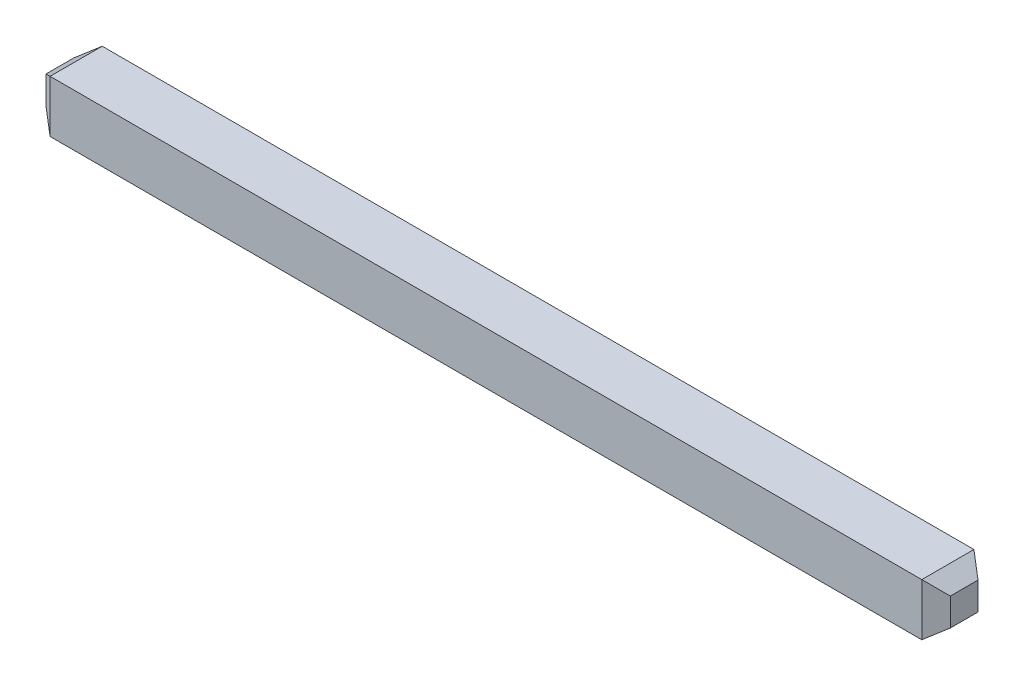
ISO-10303-21;
HEADER;
FILE_DESCRIPTION(('STEP AP214'),'2;1');
FILE_NAME('part.step','',(''),(''),'','','');
FILE_SCHEMA(('AUTOMOTIVE_DESIGN { 1 0 10303 214 1 1 1 1 }'));
ENDSEC;
DATA;
#1=APPLICATION_CONTEXT('core data for automotive mechanical design processes');
#2=APPLICATION_PROTOCOL_DEFINITION('international standard','automotive_design',2000,#1);
#3=PRODUCT_CONTEXT('',#1,'mechanical');
#4=PRODUCT('Part','Part','',(#3));
#5=PRODUCT_RELATED_PRODUCT_CATEGORY('part','',(#4));
#6=PRODUCT_DEFINITION_FORMATION('','',#4);
#7=PRODUCT_DEFINITION_CONTEXT('part definition',#1,'design');
#8=PRODUCT_DEFINITION('design','',#6,#7);
#9=PRODUCT_DEFINITION_SHAPE('','',#8);
#10=(LENGTH_UNIT() NAMED_UNIT(*) SI_UNIT(.MILLI.,.METRE.));
#11=(NAMED_UNIT(*) PLANE_ANGLE_UNIT() SI_UNIT($,.RADIAN.));
#12=(NAMED_UNIT(*) SI_UNIT($,.STERADIAN.) SOLID_ANGLE_UNIT());
#13=UNCERTAINTY_MEASURE_WITH_UNIT(LENGTH_MEASURE(1.E-05),#10,'distance_accuracy_value','');
#14=(GEOMETRIC_REPRESENTATION_CONTEXT(3) GLOBAL_UNCERTAINTY_ASSIGNED_CONTEXT((#13)) GLOBAL_UNIT_ASSIGNED_CONTEXT((#10,
#11,#12)) REPRESENTATION_CONTEXT('',''));
#15=CARTESIAN_POINT('',(0.,0.,0.));
#16=DIRECTION('',(0.,0.,1.));
#17=DIRECTION('',(1.,0.,0.));
#18=AXIS2_PLACEMENT_3D('',#15,#16,#17);
#19=CARTESIAN_POINT('',(-2.4,3.525,-11.43));
#20=DIRECTION('',(0.6,0.8,0.));
#21=DIRECTION('',(-0.8,0.6,0.));
#22=AXIS2_PLACEMENT_3D('',#19,#20,#21);
#23=PLANE('',#22);
#24=DIRECTION('',(0.,0.,1.));
#25=VECTOR('',#24,1.);
#26=CARTESIAN_POINT('',(-2.3,3.45,-11.43));
#27=LINE('',#26,#25);
#28=CARTESIAN_POINT('',(-2.29999999999978,3.45,-11.7499999999997));
#29=VERTEX_POINT('',#28);
#30=CARTESIAN_POINT('',(-2.29999999999978,3.45,-11.1100000000003));
#31=VERTEX_POINT('',#30);
#32=EDGE_CURVE('E105',#29,#31,#27,.T.);
#33=ORIENTED_EDGE('',*,*,#32,.T.);
#34=DIRECTION('',(0.685994340575993,-0.514495755427528,0.514495755419581));
#35=VECTOR('',#34,1.);
#36=CARTESIAN_POINT('',(-2.50000000000087,3.6,-11.2599999999988));
#37=LINE('',#36,#35);
#38=CARTESIAN_POINT('',(-2.50000000000022,3.6,-11.2599999999997));
#39=VERTEX_POINT('',#38);
#40=EDGE_CURVE('E92',#39,#31,#37,.T.);
#41=ORIENTED_EDGE('',*,*,#40,.F.);
#42=DIRECTION('',(0.,0.,-1.));
#43=VECTOR('',#42,1.);
#44=CARTESIAN_POINT('',(-2.5,3.6,-11.43));
#45=LINE('',#44,#43);
#46=CARTESIAN_POINT('',(-2.50000000000044,3.6,-11.6000000000006));
#47=VERTEX_POINT('',#46);
#48=EDGE_CURVE('E79',#39,#47,#45,.T.);
#49=ORIENTED_EDGE('',*,*,#48,.T.);
#50=DIRECTION('',(0.685994340575993,-0.514495755427525,-0.514495755419585));
#51=VECTOR('',#50,1.);
#52=CARTESIAN_POINT('',(-2.50000000000087,3.6,-11.6000000000012));
#53=LINE('',#52,#51);
#54=EDGE_CURVE('E20',#47,#29,#53,.T.);
#55=ORIENTED_EDGE('',*,*,#54,.T.);
#56=EDGE_LOOP('',(#33,#41,#49,#55));
#57=FACE_BOUND('',#56,.T.);
#58=ADVANCED_FACE('F17',(#57),#23,.F.);
#59=CARTESIAN_POINT('',(8.5,3.525,-11.43));
#60=DIRECTION('',(-0.6,0.8,0.));
#61=DIRECTION('',(-0.8,-0.6,0.));
#62=AXIS2_PLACEMENT_3D('',#59,#60,#61);
#63=PLANE('',#62);
#64=DIRECTION('',(0.,0.,-1.));
#65=VECTOR('',#64,1.);
#66=CARTESIAN_POINT('',(8.6,3.6,-11.43));
#67=LINE('',#66,#65);
#68=CARTESIAN_POINT('',(8.60000000000043,3.6,-11.2599999999994));
#69=VERTEX_POINT('',#68);
#70=CARTESIAN_POINT('',(8.60000000000022,3.6,-11.6000000000003));
#71=VERTEX_POINT('',#70);
#72=EDGE_CURVE('E114',#69,#71,#67,.T.);
#73=ORIENTED_EDGE('',*,*,#72,.F.);
#74=DIRECTION('',(0.685994340575991,0.514495755427529,-0.514495755419583));
#75=VECTOR('',#74,1.);
#76=CARTESIAN_POINT('',(8.39999999999913,3.45,-11.1100000000012));
#77=LINE('',#76,#75);
#78=CARTESIAN_POINT('',(8.39999999999989,3.45,-11.1100000000001));
#79=VERTEX_POINT('',#78);
#80=EDGE_CURVE('E109',#79,#69,#77,.T.);
#81=ORIENTED_EDGE('',*,*,#80,.F.);
#82=DIRECTION('',(0.,0.,1.));
#83=VECTOR('',#82,1.);
#84=CARTESIAN_POINT('',(8.4,3.45,-11.43));
#85=LINE('',#84,#83);
#86=CARTESIAN_POINT('',(8.39999999999978,3.45,-11.7499999999997));
#87=VERTEX_POINT('',#86);
#88=EDGE_CURVE('E103',#79,#87,#85,.F.);
#89=ORIENTED_EDGE('',*,*,#88,.T.);
#90=DIRECTION('',(0.685994340575991,0.514495755427529,0.514495755419583));
#91=VECTOR('',#90,1.);
#92=CARTESIAN_POINT('',(8.39999999999913,3.45,-11.7499999999988));
#93=LINE('',#92,#91);
#94=EDGE_CURVE('E107',#87,#71,#93,.T.);
#95=ORIENTED_EDGE('',*,*,#94,.T.);
#96=EDGE_LOOP('',(#73,#81,#89,#95));
#97=FACE_BOUND('',#96,.T.);
#98=ADVANCED_FACE('F175',(#97),#63,.F.);
#99=CARTESIAN_POINT('',(-2.4,3.77,-11.675));
#100=DIRECTION('',(0.599999999990736,0.,0.800000000006948));
#101=DIRECTION('',(0.800000000006948,0.,-0.599999999990736));
#102=AXIS2_PLACEMENT_3D('',#99,#100,#101);
#103=PLANE('',#102);
#104=DIRECTION('',(0.,1.,0.));
#105=VECTOR('',#104,1.);
#106=CARTESIAN_POINT('',(-2.3,3.77,-11.75));
#107=LINE('',#106,#105);
#108=CARTESIAN_POINT('',(-2.29999999999957,4.09,-11.7499999999994));
#109=VERTEX_POINT('',#108);
#110=EDGE_CURVE('E88',#109,#29,#107,.F.);
#111=ORIENTED_EDGE('',*,*,#110,.T.);
#112=ORIENTED_EDGE('',*,*,#54,.F.);
#113=DIRECTION('',(0.,1.,0.));
#114=VECTOR('',#113,1.);
#115=CARTESIAN_POINT('',(-2.5,3.77,-11.6));
#116=LINE('',#115,#114);
#117=CARTESIAN_POINT('',(-2.50000000000043,3.94,-11.6000000000006));
#118=VERTEX_POINT('',#117);
#119=EDGE_CURVE('E85',#47,#118,#116,.T.);
#120=ORIENTED_EDGE('',*,*,#119,.T.);
#121=DIRECTION('',(-0.685994340570035,-0.514495755427526,0.514495755427529));
#122=VECTOR('',#121,1.);
#123=CARTESIAN_POINT('',(-2.3,4.09,-11.75));
#124=LINE('',#123,#122);
#125=EDGE_CURVE('E126',#109,#118,#124,.T.);
#126=ORIENTED_EDGE('',*,*,#125,.F.);
#127=EDGE_LOOP('',(#111,#112,#120,#126));
#128=FACE_BOUND('',#127,.T.);
#129=ADVANCED_FACE('F84',(#128),#103,.F.);
#130=CARTESIAN_POINT('',(-2.5,3.77,-11.43));
#131=DIRECTION('',(1.,0.,0.));
#132=DIRECTION('',(0.,0.,-1.));
#133=AXIS2_PLACEMENT_3D('',#130,#131,#132);
#134=PLANE('',#133);
#135=DIRECTION('',(0.,1.,0.));
#136=VECTOR('',#135,1.);
#137=CARTESIAN_POINT('',(-2.50000000000087,3.77,-11.2599999999988));
#138=LINE('',#137,#136);
#139=CARTESIAN_POINT('',(-2.50000000000022,3.94,-11.2599999999997));
#140=VERTEX_POINT('',#139);
#141=EDGE_CURVE('E94',#140,#39,#138,.F.);
#142=ORIENTED_EDGE('',*,*,#141,.F.);
#143=DIRECTION('',(0.,0.,1.));
#144=VECTOR('',#143,1.);
#145=CARTESIAN_POINT('',(-2.5,3.94,-11.43));
#146=LINE('',#145,#144);
#147=EDGE_CURVE('E98',#118,#140,#146,.T.);
#148=ORIENTED_EDGE('',*,*,#147,.F.);
#149=ORIENTED_EDGE('',*,*,#119,.F.);
#150=ORIENTED_EDGE('',*,*,#48,.F.);
#151=EDGE_LOOP('',(#142,#148,#149,#150));
#152=FACE_BOUND('',#151,.T.);
#153=ADVANCED_FACE('F96',(#152),#134,.F.);
#154=CARTESIAN_POINT('',(-2.4,3.77,-11.185));
#155=DIRECTION('',(-0.599999999990736,0.,0.800000000006948));
#156=DIRECTION('',(0.800000000006948,0.,0.599999999990736));
#157=AXIS2_PLACEMENT_3D('',#154,#155,#156);
#158=PLANE('',#157);
#159=ORIENTED_EDGE('',*,*,#40,.T.);
#160=DIRECTION('',(0.,1.,0.));
#161=VECTOR('',#160,1.);
#162=CARTESIAN_POINT('',(-2.3,3.77,-11.11));
#163=LINE('',#162,#161);
#164=CARTESIAN_POINT('',(-2.29999999999957,4.09,-11.1100000000006));
#165=VERTEX_POINT('',#164);
#166=EDGE_CURVE('E132',#165,#31,#163,.F.);
#167=ORIENTED_EDGE('',*,*,#166,.F.);
#168=DIRECTION('',(0.685994340570037,0.514495755427527,0.514495755427524));
#169=VECTOR('',#168,1.);
#170=CARTESIAN_POINT('',(-2.5,3.94,-11.26));
#171=LINE('',#170,#169);
#172=EDGE_CURVE('E129',#140,#165,#171,.T.);
#173=ORIENTED_EDGE('',*,*,#172,.F.);
#174=ORIENTED_EDGE('',*,*,#141,.T.);
#175=EDGE_LOOP('',(#159,#167,#173,#174));
#176=FACE_BOUND('',#175,.T.);
#177=ADVANCED_FACE('F186',(#176),#158,.T.);
#178=CARTESIAN_POINT('',(3.05,3.45,-11.43));
#179=DIRECTION('',(0.,1.,0.));
#180=DIRECTION('',(0.,0.,1.));
#181=AXIS2_PLACEMENT_3D('',#178,#179,#180);
#182=PLANE('',#181);
#183=ORIENTED_EDGE('',*,*,#32,.F.);
#184=DIRECTION('',(1.,0.,0.));
#185=VECTOR('',#184,1.);
#186=CARTESIAN_POINT('',(3.05,3.45,-11.75));
#187=LINE('',#186,#185);
#188=EDGE_CURVE('E123',#29,#87,#187,.T.);
#189=ORIENTED_EDGE('',*,*,#188,.T.);
#190=ORIENTED_EDGE('',*,*,#88,.F.);
#191=DIRECTION('',(1.,0.,0.));
#192=VECTOR('',#191,1.);
#193=CARTESIAN_POINT('',(3.05,3.45,-11.11));
#194=LINE('',#193,#192);
#195=EDGE_CURVE('E135',#31,#79,#194,.T.);
#196=ORIENTED_EDGE('',*,*,#195,.F.);
#197=EDGE_LOOP('',(#183,#189,#190,#196));
#198=FACE_BOUND('',#197,.T.);
#199=ADVANCED_FACE('F179',(#198),#182,.F.);
#200=CARTESIAN_POINT('',(8.5,3.77,-11.675));
#201=DIRECTION('',(-0.599999999990736,0.,0.800000000006948));
#202=DIRECTION('',(0.800000000006948,0.,0.599999999990736));
#203=AXIS2_PLACEMENT_3D('',#200,#201,#202);
#204=PLANE('',#203);
#205=DIRECTION('',(0.,1.,0.));
#206=VECTOR('',#205,1.);
#207=CARTESIAN_POINT('',(8.6,3.77,-11.6));
#208=LINE('',#207,#206);
#209=CARTESIAN_POINT('',(8.60000000000043,3.94,-11.6000000000006));
#210=VERTEX_POINT('',#209);
#211=EDGE_CURVE('E117',#71,#210,#208,.T.);
#212=ORIENTED_EDGE('',*,*,#211,.F.);
#213=ORIENTED_EDGE('',*,*,#94,.F.);
#214=DIRECTION('',(0.,1.,0.));
#215=VECTOR('',#214,1.);
#216=CARTESIAN_POINT('',(8.4,3.77,-11.75));
#217=LINE('',#216,#215);
#218=CARTESIAN_POINT('',(8.39999999999957,4.09,-11.7499999999994));
#219=VERTEX_POINT('',#218);
#220=EDGE_CURVE('E120',#87,#219,#217,.T.);
#221=ORIENTED_EDGE('',*,*,#220,.T.);
#222=DIRECTION('',(-0.685994340570033,0.514495755427525,-0.514495755427531));
#223=VECTOR('',#222,1.);
#224=CARTESIAN_POINT('',(8.6,3.94,-11.6));
#225=LINE('',#224,#223);
#226=EDGE_CURVE('E140',#210,#219,#225,.T.);
#227=ORIENTED_EDGE('',*,*,#226,.F.);
#228=EDGE_LOOP('',(#212,#213,#221,#227));
#229=FACE_BOUND('',#228,.T.);
#230=ADVANCED_FACE('F167',(#229),#204,.F.);
#231=CARTESIAN_POINT('',(8.5,3.77,-11.185));
#232=DIRECTION('',(0.599999999990736,0.,0.800000000006948));
#233=DIRECTION('',(0.800000000006948,0.,-0.599999999990736));
#234=AXIS2_PLACEMENT_3D('',#231,#232,#233);
#235=PLANE('',#234);
#236=DIRECTION('',(0.685994340570035,-0.514495755427526,-0.514495755427526));
#237=VECTOR('',#236,1.);
#238=CARTESIAN_POINT('',(8.4,4.09,-11.11));
#239=LINE('',#238,#237);
#240=CARTESIAN_POINT('',(8.39999999999957,4.09,-11.1100000000006));
#241=VERTEX_POINT('',#240);
#242=CARTESIAN_POINT('',(8.60000000000043,3.94,-11.2599999999994));
#243=VERTEX_POINT('',#242);
#244=EDGE_CURVE('E35',#241,#243,#239,.T.);
#245=ORIENTED_EDGE('',*,*,#244,.F.);
#246=DIRECTION('',(0.,1.,0.));
#247=VECTOR('',#246,1.);
#248=CARTESIAN_POINT('',(8.4,3.77,-11.11));
#249=LINE('',#248,#247);
#250=EDGE_CURVE('E138',#79,#241,#249,.T.);
#251=ORIENTED_EDGE('',*,*,#250,.F.);
#252=ORIENTED_EDGE('',*,*,#80,.T.);
#253=DIRECTION('',(0.,1.,0.));
#254=VECTOR('',#253,1.);
#255=CARTESIAN_POINT('',(8.6,3.77,-11.26));
#256=LINE('',#255,#254);
#257=EDGE_CURVE('E111',#243,#69,#256,.F.);
#258=ORIENTED_EDGE('',*,*,#257,.F.);
#259=EDGE_LOOP('',(#245,#251,#252,#258));
#260=FACE_BOUND('',#259,.T.);
#261=ADVANCED_FACE('F211',(#260),#235,.T.);
#262=CARTESIAN_POINT('',(8.6,3.77,-11.43));
#263=DIRECTION('',(1.,0.,0.));
#264=DIRECTION('',(0.,0.,-1.));
#265=AXIS2_PLACEMENT_3D('',#262,#263,#264);
#266=PLANE('',#265);
#267=ORIENTED_EDGE('',*,*,#211,.T.);
#268=DIRECTION('',(0.,0.,1.));
#269=VECTOR('',#268,1.);
#270=CARTESIAN_POINT('',(8.6,3.94,-11.43));
#271=LINE('',#270,#269);
#272=EDGE_CURVE('E144',#243,#210,#271,.F.);
#273=ORIENTED_EDGE('',*,*,#272,.F.);
#274=ORIENTED_EDGE('',*,*,#257,.T.);
#275=ORIENTED_EDGE('',*,*,#72,.T.);
#276=EDGE_LOOP('',(#267,#273,#274,#275));
#277=FACE_BOUND('',#276,.T.);
#278=ADVANCED_FACE('F172',(#277),#266,.T.);
#279=CARTESIAN_POINT('',(3.05,3.77,-11.75));
#280=DIRECTION('',(0.,0.,1.));
#281=DIRECTION('',(1.,0.,0.));
#282=AXIS2_PLACEMENT_3D('',#279,#280,#281);
#283=PLANE('',#282);
#284=ORIENTED_EDGE('',*,*,#110,.F.);
#285=DIRECTION('',(1.,0.,0.));
#286=VECTOR('',#285,1.);
#287=CARTESIAN_POINT('',(3.05,4.09,-11.75));
#288=LINE('',#287,#286);
#289=EDGE_CURVE('E147',#219,#109,#288,.F.);
#290=ORIENTED_EDGE('',*,*,#289,.F.);
#291=ORIENTED_EDGE('',*,*,#220,.F.);
#292=ORIENTED_EDGE('',*,*,#188,.F.);
#293=EDGE_LOOP('',(#284,#290,#291,#292));
#294=FACE_BOUND('',#293,.T.);
#295=ADVANCED_FACE('F181',(#294),#283,.F.);
#296=CARTESIAN_POINT('',(-2.4,4.015,-11.43));
#297=DIRECTION('',(-0.6,0.8,0.));
#298=DIRECTION('',(-0.8,-0.6,0.));
#299=AXIS2_PLACEMENT_3D('',#296,#297,#298);
#300=PLANE('',#299);
#301=ORIENTED_EDGE('',*,*,#172,.T.);
#302=DIRECTION('',(0.,0.,1.));
#303=VECTOR('',#302,1.);
#304=CARTESIAN_POINT('',(-2.3,4.09,-11.43));
#305=LINE('',#304,#303);
#306=EDGE_CURVE('E150',#109,#165,#305,.T.);
#307=ORIENTED_EDGE('',*,*,#306,.F.);
#308=ORIENTED_EDGE('',*,*,#125,.T.);
#309=ORIENTED_EDGE('',*,*,#147,.T.);
#310=EDGE_LOOP('',(#301,#307,#308,#309));
#311=FACE_BOUND('',#310,.T.);
#312=ADVANCED_FACE('F183',(#311),#300,.T.);
#313=CARTESIAN_POINT('',(3.05,3.77,-11.11));
#314=DIRECTION('',(0.,0.,1.));
#315=DIRECTION('',(1.,0.,0.));
#316=AXIS2_PLACEMENT_3D('',#313,#314,#315);
#317=PLANE('',#316);
#318=ORIENTED_EDGE('',*,*,#195,.T.);
#319=ORIENTED_EDGE('',*,*,#250,.T.);
#320=DIRECTION('',(1.,0.,0.));
#321=VECTOR('',#320,1.);
#322=CARTESIAN_POINT('',(3.05,4.09,-11.11));
#323=LINE('',#322,#321);
#324=EDGE_CURVE('E26',#165,#241,#323,.T.);
#325=ORIENTED_EDGE('',*,*,#324,.F.);
#326=ORIENTED_EDGE('',*,*,#166,.T.);
#327=EDGE_LOOP('',(#318,#319,#325,#326));
#328=FACE_BOUND('',#327,.T.);
#329=ADVANCED_FACE('F160',(#328),#317,.T.);
#330=CARTESIAN_POINT('',(8.5,4.015,-11.43));
#331=DIRECTION('',(0.6,0.8,0.));
#332=DIRECTION('',(-0.8,0.6,0.));
#333=AXIS2_PLACEMENT_3D('',#330,#331,#332);
#334=PLANE('',#333);
#335=ORIENTED_EDGE('',*,*,#244,.T.);
#336=ORIENTED_EDGE('',*,*,#272,.T.);
#337=ORIENTED_EDGE('',*,*,#226,.T.);
#338=DIRECTION('',(0.,0.,1.));
#339=VECTOR('',#338,1.);
#340=CARTESIAN_POINT('',(8.4,4.09,-11.43));
#341=LINE('',#340,#339);
#342=EDGE_CURVE('E11',#241,#219,#341,.F.);
#343=ORIENTED_EDGE('',*,*,#342,.F.);
#344=EDGE_LOOP('',(#335,#336,#337,#343));
#345=FACE_BOUND('',#344,.T.);
#346=ADVANCED_FACE('F163',(#345),#334,.T.);
#347=CARTESIAN_POINT('',(3.05,4.09,-11.43));
#348=DIRECTION('',(0.,1.,0.));
#349=DIRECTION('',(0.,0.,1.));
#350=AXIS2_PLACEMENT_3D('',#347,#348,#349);
#351=PLANE('',#350);
#352=ORIENTED_EDGE('',*,*,#324,.T.);
#353=ORIENTED_EDGE('',*,*,#342,.T.);
#354=ORIENTED_EDGE('',*,*,#289,.T.);
#355=ORIENTED_EDGE('',*,*,#306,.T.);
#356=EDGE_LOOP('',(#352,#353,#354,#355));
#357=FACE_BOUND('',#356,.T.);
#358=ADVANCED_FACE('F156',(#357),#351,.T.);
#359=CLOSED_SHELL('',(#58,#98,#129,#153,#177,#199,#230,#261,#278,#295,#312,#329,#346,#358));
#360=MANIFOLD_SOLID_BREP('B1',#359);
#361=ADVANCED_BREP_SHAPE_REPRESENTATION('',(#18,#360),#14);
#362=SHAPE_DEFINITION_REPRESENTATION(#9,#361);
ENDSEC;
END-ISO-10303-21;
